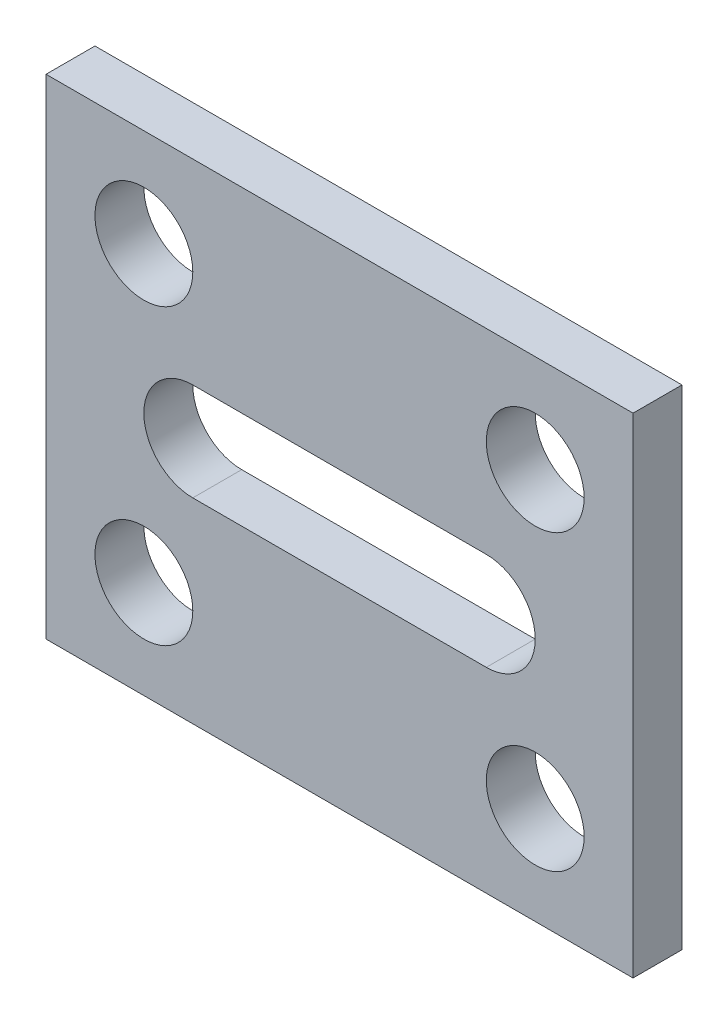
ISO-10303-21;
HEADER;
FILE_DESCRIPTION(('STEP AP214'),'2;1');
FILE_NAME('part.step','',(''),(''),'','','');
FILE_SCHEMA(('AUTOMOTIVE_DESIGN { 1 0 10303 214 1 1 1 1 }'));
ENDSEC;
DATA;
#1=APPLICATION_CONTEXT('core data for automotive mechanical design processes');
#2=APPLICATION_PROTOCOL_DEFINITION('international standard','automotive_design',2000,#1);
#3=PRODUCT_CONTEXT('',#1,'mechanical');
#4=PRODUCT('Part','Part','',(#3));
#5=PRODUCT_RELATED_PRODUCT_CATEGORY('part','',(#4));
#6=PRODUCT_DEFINITION_FORMATION('','',#4);
#7=PRODUCT_DEFINITION_CONTEXT('part definition',#1,'design');
#8=PRODUCT_DEFINITION('design','',#6,#7);
#9=PRODUCT_DEFINITION_SHAPE('','',#8);
#10=(LENGTH_UNIT() NAMED_UNIT(*) SI_UNIT(.MILLI.,.METRE.));
#11=(NAMED_UNIT(*) PLANE_ANGLE_UNIT() SI_UNIT($,.RADIAN.));
#12=(NAMED_UNIT(*) SI_UNIT($,.STERADIAN.) SOLID_ANGLE_UNIT());
#13=UNCERTAINTY_MEASURE_WITH_UNIT(LENGTH_MEASURE(1.E-05),#10,'distance_accuracy_value','');
#14=(GEOMETRIC_REPRESENTATION_CONTEXT(3) GLOBAL_UNCERTAINTY_ASSIGNED_CONTEXT((#13)) GLOBAL_UNIT_ASSIGNED_CONTEXT((#10,
#11,#12)) REPRESENTATION_CONTEXT('',''));
#15=CARTESIAN_POINT('',(0.,0.,0.));
#16=DIRECTION('',(0.,0.,1.));
#17=DIRECTION('',(1.,0.,0.));
#18=AXIS2_PLACEMENT_3D('',#15,#16,#17);
#19=CARTESIAN_POINT('',(0.,0.,10.));
#20=DIRECTION('',(0.,0.,-1.));
#21=DIRECTION('',(-1.,0.,0.));
#22=AXIS2_PLACEMENT_3D('',#19,#20,#21);
#23=PLANE('',#22);
#24=CARTESIAN_POINT('',(20.0000000000006,20.,10.));
#25=DIRECTION('',(0.,0.,1.));
#26=DIRECTION('',(1.,0.,0.));
#27=AXIS2_PLACEMENT_3D('',#24,#25,#26);
#28=CIRCLE('',#27,10.);
#29=CARTESIAN_POINT('',(30.0000000000006,20.,10.));
#30=VERTEX_POINT('',#29);
#31=EDGE_CURVE('E134',#30,#30,#28,.T.);
#32=ORIENTED_EDGE('',*,*,#31,.F.);
#33=EDGE_LOOP('',(#32));
#34=FACE_BOUND('',#33,.T.);
#35=CARTESIAN_POINT('',(100.000000000001,20.0000000000011,10.));
#36=DIRECTION('',(0.,0.,1.));
#37=DIRECTION('',(1.,0.,0.));
#38=AXIS2_PLACEMENT_3D('',#35,#36,#37);
#39=CIRCLE('',#38,9.99999999999999);
#40=CARTESIAN_POINT('',(110.000000000001,20.0000000000011,10.));
#41=VERTEX_POINT('',#40);
#42=EDGE_CURVE('E140',#41,#41,#39,.T.);
#43=ORIENTED_EDGE('',*,*,#42,.F.);
#44=EDGE_LOOP('',(#43));
#45=FACE_BOUND('',#44,.T.);
#46=CARTESIAN_POINT('',(100.,80.0000000000011,10.));
#47=DIRECTION('',(0.,0.,1.));
#48=DIRECTION('',(1.,0.,0.));
#49=AXIS2_PLACEMENT_3D('',#46,#47,#48);
#50=CIRCLE('',#49,10.);
#51=CARTESIAN_POINT('',(110.,80.0000000000011,10.));
#52=VERTEX_POINT('',#51);
#53=EDGE_CURVE('E146',#52,#52,#50,.T.);
#54=ORIENTED_EDGE('',*,*,#53,.F.);
#55=EDGE_LOOP('',(#54));
#56=FACE_BOUND('',#55,.T.);
#57=CARTESIAN_POINT('',(20.,80.0000000000003,10.));
#58=DIRECTION('',(0.,0.,1.));
#59=DIRECTION('',(1.,0.,0.));
#60=AXIS2_PLACEMENT_3D('',#57,#58,#59);
#61=CIRCLE('',#60,9.99999999999992);
#62=CARTESIAN_POINT('',(29.9999999999999,80.0000000000003,10.));
#63=VERTEX_POINT('',#62);
#64=EDGE_CURVE('E152',#63,#63,#61,.T.);
#65=ORIENTED_EDGE('',*,*,#64,.F.);
#66=EDGE_LOOP('',(#65));
#67=FACE_BOUND('',#66,.T.);
#68=DIRECTION('',(0.,-1.,0.));
#69=VECTOR('',#68,1.);
#70=CARTESIAN_POINT('',(0.,0.,10.));
#71=LINE('',#70,#69);
#72=CARTESIAN_POINT('',(0.,100.,10.));
#73=VERTEX_POINT('',#72);
#74=CARTESIAN_POINT('',(0.,0.,10.));
#75=VERTEX_POINT('',#74);
#76=EDGE_CURVE('E158',#73,#75,#71,.T.);
#77=ORIENTED_EDGE('',*,*,#76,.T.);
#78=DIRECTION('',(1.,0.,0.));
#79=VECTOR('',#78,1.);
#80=CARTESIAN_POINT('',(0.,0.,10.));
#81=LINE('',#80,#79);
#82=CARTESIAN_POINT('',(120.,0.,10.));
#83=VERTEX_POINT('',#82);
#84=EDGE_CURVE('E161',#75,#83,#81,.T.);
#85=ORIENTED_EDGE('',*,*,#84,.T.);
#86=DIRECTION('',(0.,1.,0.));
#87=VECTOR('',#86,1.);
#88=CARTESIAN_POINT('',(120.,0.,10.));
#89=LINE('',#88,#87);
#90=CARTESIAN_POINT('',(120.,100.,10.));
#91=VERTEX_POINT('',#90);
#92=EDGE_CURVE('E164',#83,#91,#89,.T.);
#93=ORIENTED_EDGE('',*,*,#92,.T.);
#94=DIRECTION('',(-1.,0.,0.));
#95=VECTOR('',#94,1.);
#96=CARTESIAN_POINT('',(0.,100.,10.));
#97=LINE('',#96,#95);
#98=EDGE_CURVE('E166',#91,#73,#97,.T.);
#99=ORIENTED_EDGE('',*,*,#98,.T.);
#100=EDGE_LOOP('',(#77,#85,#93,#99));
#101=FACE_BOUND('',#100,.T.);
#102=CARTESIAN_POINT('',(30.,50.,10.));
#103=DIRECTION('',(0.,0.,1.));
#104=DIRECTION('',(1.,0.,0.));
#105=AXIS2_PLACEMENT_3D('',#102,#103,#104);
#106=CIRCLE('',#105,9.99999999999999);
#107=CARTESIAN_POINT('',(30.,60.,10.));
#108=VERTEX_POINT('',#107);
#109=CARTESIAN_POINT('',(30.,40.,10.));
#110=VERTEX_POINT('',#109);
#111=EDGE_CURVE('E98',#108,#110,#106,.T.);
#112=ORIENTED_EDGE('',*,*,#111,.F.);
#113=DIRECTION('',(-1.,0.,0.));
#114=VECTOR('',#113,1.);
#115=CARTESIAN_POINT('',(30.,60.,10.));
#116=LINE('',#115,#114);
#117=CARTESIAN_POINT('',(90.,60.,10.));
#118=VERTEX_POINT('',#117);
#119=EDGE_CURVE('E120',#118,#108,#116,.T.);
#120=ORIENTED_EDGE('',*,*,#119,.F.);
#121=CARTESIAN_POINT('',(90.,50.,10.));
#122=DIRECTION('',(0.,0.,1.));
#123=DIRECTION('',(1.,0.,0.));
#124=AXIS2_PLACEMENT_3D('',#121,#122,#123);
#125=CIRCLE('',#124,9.99999999999999);
#126=CARTESIAN_POINT('',(90.,40.,10.));
#127=VERTEX_POINT('',#126);
#128=EDGE_CURVE('E118',#127,#118,#125,.T.);
#129=ORIENTED_EDGE('',*,*,#128,.F.);
#130=DIRECTION('',(1.,0.,0.));
#131=VECTOR('',#130,1.);
#132=CARTESIAN_POINT('',(30.,40.,10.));
#133=LINE('',#132,#131);
#134=EDGE_CURVE('E106',#110,#127,#133,.T.);
#135=ORIENTED_EDGE('',*,*,#134,.F.);
#136=EDGE_LOOP('',(#112,#120,#129,#135));
#137=FACE_BOUND('',#136,.T.);
#138=ADVANCED_FACE('F33',(#34,#45,#56,#67,#101,#137),#23,.F.);
#139=CARTESIAN_POINT('',(0.,0.,0.));
#140=DIRECTION('',(0.,0.,-1.));
#141=DIRECTION('',(-1.,0.,0.));
#142=AXIS2_PLACEMENT_3D('',#139,#140,#141);
#143=PLANE('',#142);
#144=CARTESIAN_POINT('',(100.000000000001,20.0000000000011,0.));
#145=DIRECTION('',(0.,0.,1.));
#146=DIRECTION('',(1.,0.,0.));
#147=AXIS2_PLACEMENT_3D('',#144,#145,#146);
#148=CIRCLE('',#147,9.99999999999999);
#149=CARTESIAN_POINT('',(110.000000000001,20.0000000000011,0.));
#150=VERTEX_POINT('',#149);
#151=EDGE_CURVE('E137',#150,#150,#148,.T.);
#152=ORIENTED_EDGE('',*,*,#151,.T.);
#153=EDGE_LOOP('',(#152));
#154=FACE_BOUND('',#153,.T.);
#155=CARTESIAN_POINT('',(20.,80.0000000000003,0.));
#156=DIRECTION('',(0.,0.,1.));
#157=DIRECTION('',(1.,0.,0.));
#158=AXIS2_PLACEMENT_3D('',#155,#156,#157);
#159=CIRCLE('',#158,9.99999999999992);
#160=CARTESIAN_POINT('',(29.9999999999999,80.0000000000003,0.));
#161=VERTEX_POINT('',#160);
#162=EDGE_CURVE('E149',#161,#161,#159,.T.);
#163=ORIENTED_EDGE('',*,*,#162,.T.);
#164=EDGE_LOOP('',(#163));
#165=FACE_BOUND('',#164,.T.);
#166=DIRECTION('',(0.,-1.,0.));
#167=VECTOR('',#166,1.);
#168=CARTESIAN_POINT('',(0.,0.,0.));
#169=LINE('',#168,#167);
#170=CARTESIAN_POINT('',(0.,100.,0.));
#171=VERTEX_POINT('',#170);
#172=CARTESIAN_POINT('',(0.,0.,0.));
#173=VERTEX_POINT('',#172);
#174=EDGE_CURVE('E155',#171,#173,#169,.T.);
#175=ORIENTED_EDGE('',*,*,#174,.F.);
#176=DIRECTION('',(-1.,0.,0.));
#177=VECTOR('',#176,1.);
#178=CARTESIAN_POINT('',(0.,100.,0.));
#179=LINE('',#178,#177);
#180=CARTESIAN_POINT('',(120.,100.,0.));
#181=VERTEX_POINT('',#180);
#182=EDGE_CURVE('E162',#181,#171,#179,.T.);
#183=ORIENTED_EDGE('',*,*,#182,.F.);
#184=DIRECTION('',(0.,1.,0.));
#185=VECTOR('',#184,1.);
#186=CARTESIAN_POINT('',(120.,0.,0.));
#187=LINE('',#186,#185);
#188=CARTESIAN_POINT('',(120.,0.,0.));
#189=VERTEX_POINT('',#188);
#190=EDGE_CURVE('E173',#189,#181,#187,.T.);
#191=ORIENTED_EDGE('',*,*,#190,.F.);
#192=DIRECTION('',(1.,0.,0.));
#193=VECTOR('',#192,1.);
#194=CARTESIAN_POINT('',(0.,0.,0.));
#195=LINE('',#194,#193);
#196=EDGE_CURVE('E171',#173,#189,#195,.T.);
#197=ORIENTED_EDGE('',*,*,#196,.F.);
#198=EDGE_LOOP('',(#175,#183,#191,#197));
#199=FACE_BOUND('',#198,.T.);
#200=CARTESIAN_POINT('',(100.,80.0000000000011,0.));
#201=DIRECTION('',(0.,0.,1.));
#202=DIRECTION('',(1.,0.,0.));
#203=AXIS2_PLACEMENT_3D('',#200,#201,#202);
#204=CIRCLE('',#203,10.);
#205=CARTESIAN_POINT('',(110.,80.0000000000011,0.));
#206=VERTEX_POINT('',#205);
#207=EDGE_CURVE('E143',#206,#206,#204,.T.);
#208=ORIENTED_EDGE('',*,*,#207,.T.);
#209=EDGE_LOOP('',(#208));
#210=FACE_BOUND('',#209,.T.);
#211=CARTESIAN_POINT('',(20.0000000000006,20.,0.));
#212=DIRECTION('',(0.,0.,1.));
#213=DIRECTION('',(1.,0.,0.));
#214=AXIS2_PLACEMENT_3D('',#211,#212,#213);
#215=CIRCLE('',#214,10.);
#216=CARTESIAN_POINT('',(30.0000000000006,20.,0.));
#217=VERTEX_POINT('',#216);
#218=EDGE_CURVE('E114',#217,#217,#215,.T.);
#219=ORIENTED_EDGE('',*,*,#218,.T.);
#220=EDGE_LOOP('',(#219));
#221=FACE_BOUND('',#220,.T.);
#222=DIRECTION('',(-1.,0.,0.));
#223=VECTOR('',#222,1.);
#224=CARTESIAN_POINT('',(30.,60.,0.));
#225=LINE('',#224,#223);
#226=CARTESIAN_POINT('',(90.,60.,0.));
#227=VERTEX_POINT('',#226);
#228=CARTESIAN_POINT('',(30.,60.,0.));
#229=VERTEX_POINT('',#228);
#230=EDGE_CURVE('E107',#227,#229,#225,.T.);
#231=ORIENTED_EDGE('',*,*,#230,.T.);
#232=CARTESIAN_POINT('',(30.,50.,0.));
#233=DIRECTION('',(0.,0.,1.));
#234=DIRECTION('',(1.,0.,0.));
#235=AXIS2_PLACEMENT_3D('',#232,#233,#234);
#236=CIRCLE('',#235,9.99999999999999);
#237=CARTESIAN_POINT('',(30.,40.,0.));
#238=VERTEX_POINT('',#237);
#239=EDGE_CURVE('E56',#229,#238,#236,.T.);
#240=ORIENTED_EDGE('',*,*,#239,.T.);
#241=DIRECTION('',(1.,0.,0.));
#242=VECTOR('',#241,1.);
#243=CARTESIAN_POINT('',(30.,40.,0.));
#244=LINE('',#243,#242);
#245=CARTESIAN_POINT('',(90.,40.,0.));
#246=VERTEX_POINT('',#245);
#247=EDGE_CURVE('E113',#238,#246,#244,.T.);
#248=ORIENTED_EDGE('',*,*,#247,.T.);
#249=CARTESIAN_POINT('',(90.,50.,0.));
#250=DIRECTION('',(0.,0.,1.));
#251=DIRECTION('',(1.,0.,0.));
#252=AXIS2_PLACEMENT_3D('',#249,#250,#251);
#253=CIRCLE('',#252,9.99999999999999);
#254=EDGE_CURVE('E126',#246,#227,#253,.T.);
#255=ORIENTED_EDGE('',*,*,#254,.T.);
#256=EDGE_LOOP('',(#231,#240,#248,#255));
#257=FACE_BOUND('',#256,.T.);
#258=ADVANCED_FACE('F191',(#154,#165,#199,#210,#221,#257),#143,.T.);
#259=CARTESIAN_POINT('',(0.,0.,10.));
#260=DIRECTION('',(1.,0.,0.));
#261=DIRECTION('',(0.,0.,-1.));
#262=AXIS2_PLACEMENT_3D('',#259,#260,#261);
#263=PLANE('',#262);
#264=ORIENTED_EDGE('',*,*,#174,.T.);
#265=DIRECTION('',(0.,0.,-1.));
#266=VECTOR('',#265,1.);
#267=CARTESIAN_POINT('',(0.,0.,10.));
#268=LINE('',#267,#266);
#269=EDGE_CURVE('E11',#75,#173,#268,.T.);
#270=ORIENTED_EDGE('',*,*,#269,.F.);
#271=ORIENTED_EDGE('',*,*,#76,.F.);
#272=DIRECTION('',(0.,0.,-1.));
#273=VECTOR('',#272,1.);
#274=CARTESIAN_POINT('',(0.,100.,10.));
#275=LINE('',#274,#273);
#276=EDGE_CURVE('E168',#73,#171,#275,.T.);
#277=ORIENTED_EDGE('',*,*,#276,.T.);
#278=EDGE_LOOP('',(#264,#270,#271,#277));
#279=FACE_BOUND('',#278,.T.);
#280=ADVANCED_FACE('F35',(#279),#263,.F.);
#281=CARTESIAN_POINT('',(0.,0.,10.));
#282=DIRECTION('',(0.,1.,0.));
#283=DIRECTION('',(0.,0.,1.));
#284=AXIS2_PLACEMENT_3D('',#281,#282,#283);
#285=PLANE('',#284);
#286=ORIENTED_EDGE('',*,*,#196,.T.);
#287=DIRECTION('',(0.,0.,-1.));
#288=VECTOR('',#287,1.);
#289=CARTESIAN_POINT('',(120.,0.,10.));
#290=LINE('',#289,#288);
#291=EDGE_CURVE('E41',#83,#189,#290,.T.);
#292=ORIENTED_EDGE('',*,*,#291,.F.);
#293=ORIENTED_EDGE('',*,*,#84,.F.);
#294=ORIENTED_EDGE('',*,*,#269,.T.);
#295=EDGE_LOOP('',(#286,#292,#293,#294));
#296=FACE_BOUND('',#295,.T.);
#297=ADVANCED_FACE('F201',(#296),#285,.F.);
#298=CARTESIAN_POINT('',(120.,0.,10.));
#299=DIRECTION('',(-1.,0.,0.));
#300=DIRECTION('',(0.,0.,1.));
#301=AXIS2_PLACEMENT_3D('',#298,#299,#300);
#302=PLANE('',#301);
#303=ORIENTED_EDGE('',*,*,#190,.T.);
#304=DIRECTION('',(0.,0.,-1.));
#305=VECTOR('',#304,1.);
#306=CARTESIAN_POINT('',(120.,100.,10.));
#307=LINE('',#306,#305);
#308=EDGE_CURVE('E178',#91,#181,#307,.T.);
#309=ORIENTED_EDGE('',*,*,#308,.F.);
#310=ORIENTED_EDGE('',*,*,#92,.F.);
#311=ORIENTED_EDGE('',*,*,#291,.T.);
#312=EDGE_LOOP('',(#303,#309,#310,#311));
#313=FACE_BOUND('',#312,.T.);
#314=ADVANCED_FACE('F185',(#313),#302,.F.);
#315=CARTESIAN_POINT('',(0.,100.,10.));
#316=DIRECTION('',(0.,-1.,0.));
#317=DIRECTION('',(0.,0.,-1.));
#318=AXIS2_PLACEMENT_3D('',#315,#316,#317);
#319=PLANE('',#318);
#320=ORIENTED_EDGE('',*,*,#182,.T.);
#321=ORIENTED_EDGE('',*,*,#276,.F.);
#322=ORIENTED_EDGE('',*,*,#98,.F.);
#323=ORIENTED_EDGE('',*,*,#308,.T.);
#324=EDGE_LOOP('',(#320,#321,#322,#323));
#325=FACE_BOUND('',#324,.T.);
#326=ADVANCED_FACE('F195',(#325),#319,.F.);
#327=CARTESIAN_POINT('',(20.,80.0000000000003,10.));
#328=DIRECTION('',(0.,0.,-1.));
#329=DIRECTION('',(-1.,0.,0.));
#330=AXIS2_PLACEMENT_3D('',#327,#328,#329);
#331=CYLINDRICAL_SURFACE('',#330,9.99999999999992);
#332=ORIENTED_EDGE('',*,*,#64,.T.);
#333=EDGE_LOOP('',(#332));
#334=FACE_BOUND('',#333,.T.);
#335=ORIENTED_EDGE('',*,*,#162,.F.);
#336=EDGE_LOOP('',(#335));
#337=FACE_BOUND('',#336,.T.);
#338=ADVANCED_FACE('F219',(#334,#337),#331,.F.);
#339=CARTESIAN_POINT('',(100.,80.0000000000011,10.));
#340=DIRECTION('',(0.,0.,-1.));
#341=DIRECTION('',(-1.,0.,0.));
#342=AXIS2_PLACEMENT_3D('',#339,#340,#341);
#343=CYLINDRICAL_SURFACE('',#342,10.);
#344=ORIENTED_EDGE('',*,*,#53,.T.);
#345=EDGE_LOOP('',(#344));
#346=FACE_BOUND('',#345,.T.);
#347=ORIENTED_EDGE('',*,*,#207,.F.);
#348=EDGE_LOOP('',(#347));
#349=FACE_BOUND('',#348,.T.);
#350=ADVANCED_FACE('F226',(#346,#349),#343,.F.);
#351=CARTESIAN_POINT('',(100.000000000001,20.0000000000011,10.));
#352=DIRECTION('',(0.,0.,-1.));
#353=DIRECTION('',(-1.,0.,0.));
#354=AXIS2_PLACEMENT_3D('',#351,#352,#353);
#355=CYLINDRICAL_SURFACE('',#354,9.99999999999999);
#356=ORIENTED_EDGE('',*,*,#42,.T.);
#357=EDGE_LOOP('',(#356));
#358=FACE_BOUND('',#357,.T.);
#359=ORIENTED_EDGE('',*,*,#151,.F.);
#360=EDGE_LOOP('',(#359));
#361=FACE_BOUND('',#360,.T.);
#362=ADVANCED_FACE('F231',(#358,#361),#355,.F.);
#363=CARTESIAN_POINT('',(20.0000000000006,20.,10.));
#364=DIRECTION('',(0.,0.,-1.));
#365=DIRECTION('',(-1.,0.,0.));
#366=AXIS2_PLACEMENT_3D('',#363,#364,#365);
#367=CYLINDRICAL_SURFACE('',#366,10.);
#368=ORIENTED_EDGE('',*,*,#31,.T.);
#369=EDGE_LOOP('',(#368));
#370=FACE_BOUND('',#369,.T.);
#371=ORIENTED_EDGE('',*,*,#218,.F.);
#372=EDGE_LOOP('',(#371));
#373=FACE_BOUND('',#372,.T.);
#374=ADVANCED_FACE('F241',(#370,#373),#367,.F.);
#375=CARTESIAN_POINT('',(30.,50.,10.));
#376=DIRECTION('',(0.,0.,-1.));
#377=DIRECTION('',(-1.,0.,0.));
#378=AXIS2_PLACEMENT_3D('',#375,#376,#377);
#379=CYLINDRICAL_SURFACE('',#378,9.99999999999999);
#380=ORIENTED_EDGE('',*,*,#239,.F.);
#381=DIRECTION('',(0.,0.,-1.));
#382=VECTOR('',#381,1.);
#383=CARTESIAN_POINT('',(30.,60.,10.));
#384=LINE('',#383,#382);
#385=EDGE_CURVE('E102',#108,#229,#384,.T.);
#386=ORIENTED_EDGE('',*,*,#385,.F.);
#387=ORIENTED_EDGE('',*,*,#111,.T.);
#388=DIRECTION('',(0.,0.,-1.));
#389=VECTOR('',#388,1.);
#390=CARTESIAN_POINT('',(30.,40.,10.));
#391=LINE('',#390,#389);
#392=EDGE_CURVE('E101',#110,#238,#391,.T.);
#393=ORIENTED_EDGE('',*,*,#392,.T.);
#394=EDGE_LOOP('',(#380,#386,#387,#393));
#395=FACE_BOUND('',#394,.T.);
#396=ADVANCED_FACE('F100',(#395),#379,.F.);
#397=CARTESIAN_POINT('',(30.,40.,10.));
#398=DIRECTION('',(0.,1.,0.));
#399=DIRECTION('',(0.,0.,1.));
#400=AXIS2_PLACEMENT_3D('',#397,#398,#399);
#401=PLANE('',#400);
#402=ORIENTED_EDGE('',*,*,#247,.F.);
#403=ORIENTED_EDGE('',*,*,#392,.F.);
#404=ORIENTED_EDGE('',*,*,#134,.T.);
#405=DIRECTION('',(0.,0.,-1.));
#406=VECTOR('',#405,1.);
#407=CARTESIAN_POINT('',(90.,40.,10.));
#408=LINE('',#407,#406);
#409=EDGE_CURVE('E115',#127,#246,#408,.T.);
#410=ORIENTED_EDGE('',*,*,#409,.T.);
#411=EDGE_LOOP('',(#402,#403,#404,#410));
#412=FACE_BOUND('',#411,.T.);
#413=ADVANCED_FACE('F110',(#412),#401,.T.);
#414=CARTESIAN_POINT('',(90.,50.,10.));
#415=DIRECTION('',(0.,0.,-1.));
#416=DIRECTION('',(-1.,0.,0.));
#417=AXIS2_PLACEMENT_3D('',#414,#415,#416);
#418=CYLINDRICAL_SURFACE('',#417,9.99999999999999);
#419=ORIENTED_EDGE('',*,*,#254,.F.);
#420=ORIENTED_EDGE('',*,*,#409,.F.);
#421=ORIENTED_EDGE('',*,*,#128,.T.);
#422=DIRECTION('',(0.,0.,-1.));
#423=VECTOR('',#422,1.);
#424=CARTESIAN_POINT('',(90.,60.,10.));
#425=LINE('',#424,#423);
#426=EDGE_CURVE('E48',#118,#227,#425,.T.);
#427=ORIENTED_EDGE('',*,*,#426,.T.);
#428=EDGE_LOOP('',(#419,#420,#421,#427));
#429=FACE_BOUND('',#428,.T.);
#430=ADVANCED_FACE('F253',(#429),#418,.F.);
#431=CARTESIAN_POINT('',(30.,60.,10.));
#432=DIRECTION('',(0.,-1.,0.));
#433=DIRECTION('',(0.,0.,-1.));
#434=AXIS2_PLACEMENT_3D('',#431,#432,#433);
#435=PLANE('',#434);
#436=ORIENTED_EDGE('',*,*,#230,.F.);
#437=ORIENTED_EDGE('',*,*,#426,.F.);
#438=ORIENTED_EDGE('',*,*,#119,.T.);
#439=ORIENTED_EDGE('',*,*,#385,.T.);
#440=EDGE_LOOP('',(#436,#437,#438,#439));
#441=FACE_BOUND('',#440,.T.);
#442=ADVANCED_FACE('F256',(#441),#435,.T.);
#443=CLOSED_SHELL('',(#138,#258,#280,#297,#314,#326,#338,#350,#362,#374,#396,#413,#430,#442));
#444=MANIFOLD_SOLID_BREP('B2',#443);
#445=ADVANCED_BREP_SHAPE_REPRESENTATION('',(#18,#444),#14);
#446=SHAPE_DEFINITION_REPRESENTATION(#9,#445);
ENDSEC;
END-ISO-10303-21;
